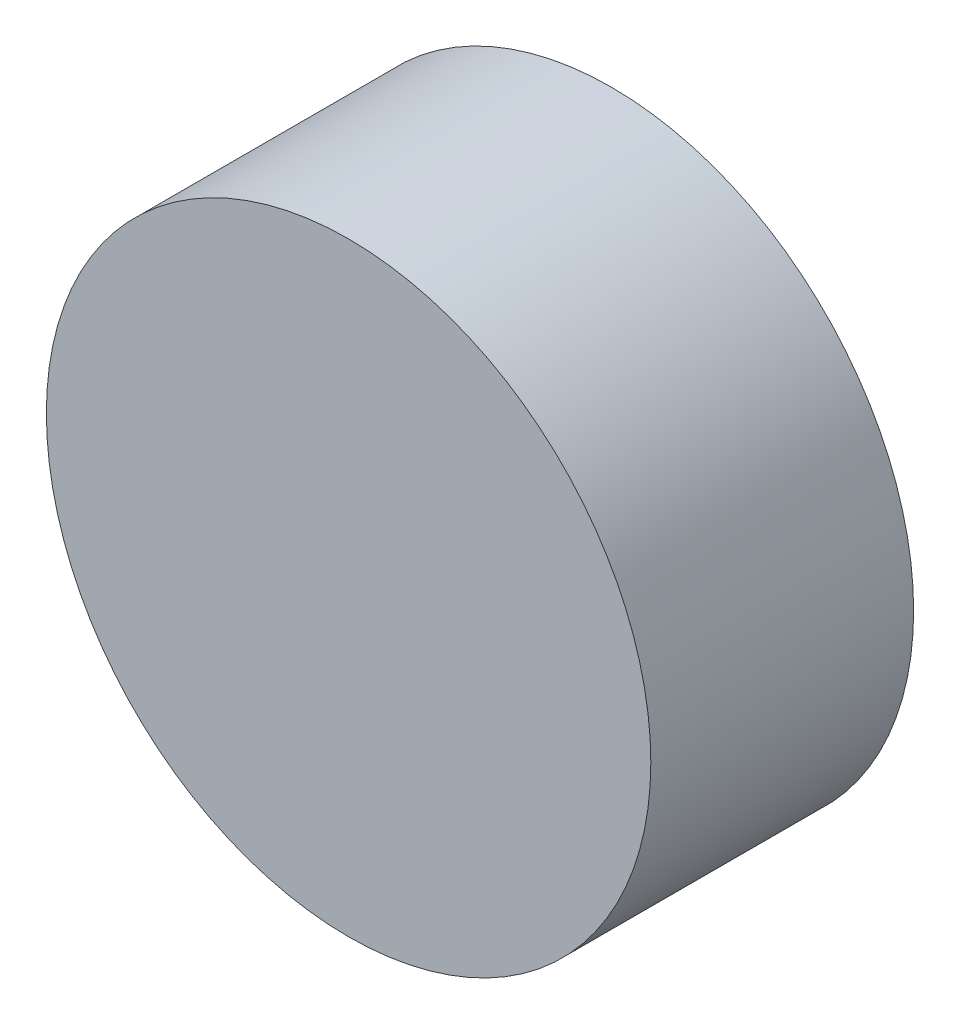
ISO-10303-21;
HEADER;
FILE_DESCRIPTION(('STEP AP214'),'2;1');
FILE_NAME('part.step','',(''),(''),'','','');
FILE_SCHEMA(('AUTOMOTIVE_DESIGN { 1 0 10303 214 1 1 1 1 }'));
ENDSEC;
DATA;
#1=APPLICATION_CONTEXT('core data for automotive mechanical design processes');
#2=APPLICATION_PROTOCOL_DEFINITION('international standard','automotive_design',2000,#1);
#3=PRODUCT_CONTEXT('',#1,'mechanical');
#4=PRODUCT('Part','Part','',(#3));
#5=PRODUCT_RELATED_PRODUCT_CATEGORY('part','',(#4));
#6=PRODUCT_DEFINITION_FORMATION('','',#4);
#7=PRODUCT_DEFINITION_CONTEXT('part definition',#1,'design');
#8=PRODUCT_DEFINITION('design','',#6,#7);
#9=PRODUCT_DEFINITION_SHAPE('','',#8);
#10=(LENGTH_UNIT() NAMED_UNIT(*) SI_UNIT(.MILLI.,.METRE.));
#11=(NAMED_UNIT(*) PLANE_ANGLE_UNIT() SI_UNIT($,.RADIAN.));
#12=(NAMED_UNIT(*) SI_UNIT($,.STERADIAN.) SOLID_ANGLE_UNIT());
#13=UNCERTAINTY_MEASURE_WITH_UNIT(LENGTH_MEASURE(1.E-05),#10,'distance_accuracy_value','');
#14=(GEOMETRIC_REPRESENTATION_CONTEXT(3) GLOBAL_UNCERTAINTY_ASSIGNED_CONTEXT((#13)) GLOBAL_UNIT_ASSIGNED_CONTEXT((#10,
#11,#12)) REPRESENTATION_CONTEXT('',''));
#15=CARTESIAN_POINT('',(0.,0.,0.));
#16=DIRECTION('',(0.,0.,1.));
#17=DIRECTION('',(1.,0.,0.));
#18=AXIS2_PLACEMENT_3D('',#15,#16,#17);
#19=CARTESIAN_POINT('',(0.,0.,5.));
#20=DIRECTION('',(0.,0.,-1.));
#21=DIRECTION('',(-1.,0.,0.));
#22=AXIS2_PLACEMENT_3D('',#19,#20,#21);
#23=CYLINDRICAL_SURFACE('',#22,5.75);
#24=CARTESIAN_POINT('',(0.,0.,5.));
#25=DIRECTION('',(0.,0.,1.));
#26=DIRECTION('',(1.,0.,0.));
#27=AXIS2_PLACEMENT_3D('',#24,#25,#26);
#28=CIRCLE('',#27,5.75);
#29=CARTESIAN_POINT('',(5.75,0.,5.));
#30=VERTEX_POINT('',#29);
#31=EDGE_CURVE('E10',#30,#30,#28,.T.);
#32=ORIENTED_EDGE('',*,*,#31,.F.);
#33=EDGE_LOOP('',(#32));
#34=FACE_BOUND('',#33,.T.);
#35=CARTESIAN_POINT('',(0.,0.,0.));
#36=DIRECTION('',(0.,0.,1.));
#37=DIRECTION('',(1.,0.,0.));
#38=AXIS2_PLACEMENT_3D('',#35,#36,#37);
#39=CIRCLE('',#38,5.75);
#40=CARTESIAN_POINT('',(5.75,0.,0.));
#41=VERTEX_POINT('',#40);
#42=EDGE_CURVE('E40',#41,#41,#39,.T.);
#43=ORIENTED_EDGE('',*,*,#42,.T.);
#44=EDGE_LOOP('',(#43));
#45=FACE_BOUND('',#44,.T.);
#46=ADVANCED_FACE('F37',(#34,#45),#23,.T.);
#47=CARTESIAN_POINT('',(0.,0.,5.));
#48=DIRECTION('',(0.,0.,1.));
#49=DIRECTION('',(1.,0.,0.));
#50=AXIS2_PLACEMENT_3D('',#47,#48,#49);
#51=PLANE('',#50);
#52=ORIENTED_EDGE('',*,*,#31,.T.);
#53=EDGE_LOOP('',(#52));
#54=FACE_BOUND('',#53,.T.);
#55=ADVANCED_FACE('F54',(#54),#51,.T.);
#56=CARTESIAN_POINT('',(0.,0.,0.));
#57=DIRECTION('',(0.,0.,1.));
#58=DIRECTION('',(1.,0.,0.));
#59=AXIS2_PLACEMENT_3D('',#56,#57,#58);
#60=PLANE('',#59);
#61=ORIENTED_EDGE('',*,*,#42,.F.);
#62=EDGE_LOOP('',(#61));
#63=FACE_BOUND('',#62,.T.);
#64=ADVANCED_FACE('F52',(#63),#60,.F.);
#65=CLOSED_SHELL('',(#46,#55,#64));
#66=MANIFOLD_SOLID_BREP('B2',#65);
#67=ADVANCED_BREP_SHAPE_REPRESENTATION('',(#18,#66),#14);
#68=SHAPE_DEFINITION_REPRESENTATION(#9,#67);
ENDSEC;
END-ISO-10303-21;
